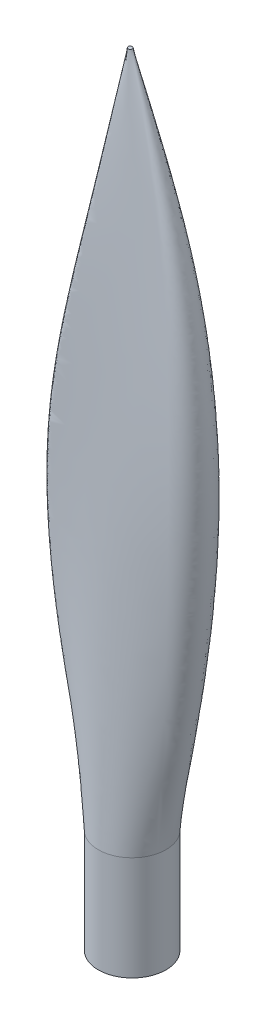
ISO-10303-21;
HEADER;
FILE_DESCRIPTION(('STEP AP214'),'2;1');
FILE_NAME('part.step','',(''),(''),'','','');
FILE_SCHEMA(('AUTOMOTIVE_DESIGN { 1 0 10303 214 1 1 1 1 }'));
ENDSEC;
DATA;
#1=APPLICATION_CONTEXT('core data for automotive mechanical design processes');
#2=APPLICATION_PROTOCOL_DEFINITION('international standard','automotive_design',2000,#1);
#3=PRODUCT_CONTEXT('',#1,'mechanical');
#4=PRODUCT('Part','Part','',(#3));
#5=PRODUCT_RELATED_PRODUCT_CATEGORY('part','',(#4));
#6=PRODUCT_DEFINITION_FORMATION('','',#4);
#7=PRODUCT_DEFINITION_CONTEXT('part definition',#1,'design');
#8=PRODUCT_DEFINITION('design','',#6,#7);
#9=PRODUCT_DEFINITION_SHAPE('','',#8);
#10=(LENGTH_UNIT() NAMED_UNIT(*) SI_UNIT(.MILLI.,.METRE.));
#11=(NAMED_UNIT(*) PLANE_ANGLE_UNIT() SI_UNIT($,.RADIAN.));
#12=(NAMED_UNIT(*) SI_UNIT($,.STERADIAN.) SOLID_ANGLE_UNIT());
#13=UNCERTAINTY_MEASURE_WITH_UNIT(LENGTH_MEASURE(1.E-05),#10,'distance_accuracy_value','');
#14=(GEOMETRIC_REPRESENTATION_CONTEXT(3) GLOBAL_UNCERTAINTY_ASSIGNED_CONTEXT((#13)) GLOBAL_UNIT_ASSIGNED_CONTEXT((#10,
#11,#12)) REPRESENTATION_CONTEXT('',''));
#15=CARTESIAN_POINT('',(0.,0.,0.));
#16=DIRECTION('',(0.,0.,1.));
#17=DIRECTION('',(1.,0.,0.));
#18=AXIS2_PLACEMENT_3D('',#15,#16,#17);
#19=CARTESIAN_POINT('',(0.,25.4,0.));
#20=DIRECTION('',(0.,-1.,0.));
#21=DIRECTION('',(0.,0.,-1.));
#22=AXIS2_PLACEMENT_3D('',#19,#20,#21);
#23=CYLINDRICAL_SURFACE('',#22,8.255);
#24=CARTESIAN_POINT('',(8.04193920322498,25.4,1.86339444338367));
#25=CARTESIAN_POINT('',(8.11469058047211,25.4,1.54941789653013));
#26=CARTESIAN_POINT('',(8.20111596359016,25.4,1.02541844738132));
#27=CARTESIAN_POINT('',(8.25713372696519,25.4,0.33787269353266));
#28=CARTESIAN_POINT('',(8.25712999938364,25.4,-0.294040831743894));
#29=CARTESIAN_POINT('',(8.21313643032507,25.4,-0.903429716545801));
#30=CARTESIAN_POINT('',(8.12374693580212,25.4,-1.50734328576073));
#31=CARTESIAN_POINT('',(7.98653543918241,25.4,-2.12325160249451));
#32=CARTESIAN_POINT('',(7.78350611399743,25.4,-2.77958408044491));
#33=CARTESIAN_POINT('',(7.5866950421925,25.4,-3.26929320480301));
#34=CARTESIAN_POINT('',(7.07615281467502,25.4,-4.33874333536382));
#35=CARTESIAN_POINT('',(6.06281840015661,25.4,-5.82189276200334));
#36=CARTESIAN_POINT('',(3.81323358915334,25.4,-7.50392490816732));
#37=CARTESIAN_POINT('',(1.03793702074819,25.4,-8.36259525259376));
#38=CARTESIAN_POINT('',(-1.93355088549847,25.4,-8.20848911095254));
#39=CARTESIAN_POINT('',(-4.69552403522382,25.4,-7.00736650120369));
#40=CARTESIAN_POINT('',(-6.85494806995589,25.4,-4.91112426952028));
#41=CARTESIAN_POINT('',(-8.12625519817877,25.4,-2.22722905695133));
#42=CARTESIAN_POINT('',(-8.30220606284296,25.4,-0.305023455910575));
#43=CARTESIAN_POINT('',(-8.22601899140763,25.4,0.694358393993185));
#44=CARTESIAN_POINT('',(-8.21596343196928,25.4,0.808584845785648));
#45=CARTESIAN_POINT('',(-8.20067106575924,25.4,0.94716211144842));
#46=CARTESIAN_POINT('',(-8.18454253711126,25.4,1.07873030970427));
#47=CARTESIAN_POINT('',(-8.16680736656137,25.4,1.20676653839371));
#48=CARTESIAN_POINT('',(-8.14669507464558,25.4,1.33474789535725));
#49=CARTESIAN_POINT('',(-8.1240024350029,25.4,1.4658351731648));
#50=CARTESIAN_POINT('',(-8.09852622127235,25.4,1.60318916438626));
#51=CARTESIAN_POINT('',(-8.0748054378678,25.4,1.71674475742405));
#52=CARTESIAN_POINT('',(-7.86392377692074,25.4,2.669782141881));
#53=CARTESIAN_POINT('',(-7.16855013672076,25.4,4.41076011906735));
#54=CARTESIAN_POINT('',(-5.25852225694168,25.3999999999999,6.58091549086592));
#55=CARTESIAN_POINT('',(-2.68411314179392,25.4,7.98747474208518));
#56=CARTESIAN_POINT('',(0.21970228756123,25.4,8.42146847642118));
#57=CARTESIAN_POINT('',(3.05849244996995,25.4,7.84240837927393));
#58=CARTESIAN_POINT('',(5.47379896842453,25.4,6.38198722144125));
#59=CARTESIAN_POINT('',(7.21609729921608,25.4,4.29178486992168));
#60=CARTESIAN_POINT('',(7.85309928772002,25.4,2.67837976492553));
#61=CARTESIAN_POINT('',(8.04193920322498,25.4,1.86339444338367));
#62=B_SPLINE_CURVE_WITH_KNOTS('',3,(#24,#25,#26,#27,#28,#29,#30,#31,#32,#33,#34,#35,#36,#37,#38,
#39,#40,#41,#42,#43,#44,#45,#46,#47,#48,#49,#50,#51,#52,#53,#54,#55,#56,#57,#58,#59,#60,#61),
.UNSPECIFIED.,.T.,.F.,(4,1,1,1,1,1,1,1,2,1,1,1,1,1,1,1,2,1,1,1,1,1,1,1,2,1,1,1,1,1,1,1,4),(0.,
0.0191823092894924,0.0383646185789849,0.0575469278684773,0.0767292371579697,0.0959115464474622,
0.115093855736955,0.134276165026447,0.153458474315939,0.205736295327291,0.258014116338642,
0.310291937349993,0.362569758361344,0.414847579372695,0.467125400384046,0.519403221395398,
0.571681042406749,0.575429611892947,0.579178181379145,0.582926750865343,0.586675320351542,
0.59042388983774,0.594172459323938,0.597921028810136,0.601669598296334,0.651460898509293,
0.701252198722251,0.751043498935209,0.800834799148167,0.850626099361125,0.900417399574084,
0.950208699787042,1.),.UNSPECIFIED.);
#63=CARTESIAN_POINT('',(8.04193920322498,25.4,1.86339444338367));
#64=VERTEX_POINT('',#63);
#65=EDGE_CURVE('E11',#64,#64,#62,.T.);
#66=ORIENTED_EDGE('',*,*,#65,.F.);
#67=EDGE_LOOP('',(#66));
#68=FACE_BOUND('',#67,.T.);
#69=CARTESIAN_POINT('',(0.,0.,0.));
#70=DIRECTION('',(0.,1.,0.));
#71=DIRECTION('',(0.,0.,1.));
#72=AXIS2_PLACEMENT_3D('',#69,#70,#71);
#73=CIRCLE('',#72,8.255);
#74=CARTESIAN_POINT('',(0.,0.,8.255));
#75=VERTEX_POINT('',#74);
#76=EDGE_CURVE('E190',#75,#75,#73,.T.);
#77=ORIENTED_EDGE('',*,*,#76,.T.);
#78=EDGE_LOOP('',(#77));
#79=FACE_BOUND('',#78,.T.);
#80=ADVANCED_FACE('F181',(#68,#79),#23,.T.);
#81=CARTESIAN_POINT('',(0.,0.,0.));
#82=DIRECTION('',(0.,1.,0.));
#83=DIRECTION('',(0.,0.,1.));
#84=AXIS2_PLACEMENT_3D('',#81,#82,#83);
#85=PLANE('',#84);
#86=ORIENTED_EDGE('',*,*,#76,.F.);
#87=EDGE_LOOP('',(#86));
#88=FACE_BOUND('',#87,.T.);
#89=ADVANCED_FACE('F205',(#88),#85,.F.);
#90=CARTESIAN_POINT('',(-0.468049409765747,190.5,0.));
#91=DIRECTION('',(0.,1.,0.));
#92=DIRECTION('',(0.,0.,1.));
#93=AXIS2_PLACEMENT_3D('',#90,#91,#92);
#94=PLANE('',#93);
#95=CARTESIAN_POINT('',(-0.468049409765747,190.5,0.));
#96=DIRECTION('',(0.,1.,0.));
#97=DIRECTION('',(0.,0.,1.));
#98=AXIS2_PLACEMENT_3D('',#95,#96,#97);
#99=CIRCLE('',#98,0.508);
#100=CARTESIAN_POINT('',(-0.468049409765747,190.5,0.508));
#101=VERTEX_POINT('',#100);
#102=EDGE_CURVE('E195',#101,#101,#99,.T.);
#103=ORIENTED_EDGE('',*,*,#102,.T.);
#104=EDGE_LOOP('',(#103));
#105=FACE_BOUND('',#104,.T.);
#106=ADVANCED_FACE('F209',(#105),#94,.T.);
#107=CARTESIAN_POINT('',(8.04193920322498,25.4,1.86339444338367));
#108=CARTESIAN_POINT('',(11.5441831228996,52.8841437795846,3.75083024995481));
#109=CARTESIAN_POINT('',(15.6087082833565,95.3193381993019,6.38417406376222));
#110=CARTESIAN_POINT('',(12.0814735561454,150.662706721941,3.34743293999606));
#111=CARTESIAN_POINT('',(3.85568550211949,177.846702543778,1.14147476846218));
#112=CARTESIAN_POINT('',(0.0268391565865594,190.5,0.114670427285149));
#113=CARTESIAN_POINT('',(8.11469058047211,25.4,1.54941789653013));
#114=CARTESIAN_POINT('',(11.8651308020688,52.8774984153459,3.55091034573232));
#115=CARTESIAN_POINT('',(16.257977972794,95.3209632198728,6.42959433380312));
#116=CARTESIAN_POINT('',(12.4353576063648,150.662452366571,3.34573554887688));
#117=CARTESIAN_POINT('',(3.97114272162727,177.8466217543,1.12775102474808));
#118=CARTESIAN_POINT('',(0.0313161644171518,190.5,0.0953487936326232));
#119=CARTESIAN_POINT('',(8.20111596359016,25.4,1.02541844738132));
#120=CARTESIAN_POINT('',(12.4820404914474,52.8621430728127,3.21985953171336));
#121=CARTESIAN_POINT('',(17.6522890450517,95.3247181303032,6.28723154333785));
#122=CARTESIAN_POINT('',(13.1887129583694,150.66186463147,3.23464229241499));
#123=CARTESIAN_POINT('',(4.21436785272417,177.846435075275,1.06975330167826));
#124=CARTESIAN_POINT('',(0.0370916774057469,190.5,0.0620653760685117));
#125=CARTESIAN_POINT('',(8.25713372696519,25.4,0.33787269353266));
#126=CARTESIAN_POINT('',(13.4021812453444,52.8389506838222,2.3661874591982));
#127=CARTESIAN_POINT('',(19.7833304047924,95.3303894686741,5.27533508309244));
#128=CARTESIAN_POINT('',(14.3321683184268,150.660976928636,2.599795193068));
#129=CARTESIAN_POINT('',(4.57939570644172,177.846153119171,0.840190590730155));
#130=CARTESIAN_POINT('',(0.0397859415223717,190.5,0.0211498365805482));
#131=CARTESIAN_POINT('',(8.25712999938364,25.4,-0.294040831743894));
#132=CARTESIAN_POINT('',(14.1299827286284,52.8204957833275,1.17414081816601));
#133=CARTESIAN_POINT('',(21.5544340915263,95.3349023278438,3.31715656233024));
#134=CARTESIAN_POINT('',(15.2340711308636,150.660270556064,1.42971503345474));
#135=CARTESIAN_POINT('',(4.86606116143318,177.845928757987,0.44194833799434));
#136=CARTESIAN_POINT('',(0.0400777029274889,190.5,-0.0178260784278905));
#137=CARTESIAN_POINT('',(8.21313643032507,25.4,-0.903429716545801));
#138=CARTESIAN_POINT('',(14.4474648245027,52.8138706939407,-0.322792730108646));
#139=CARTESIAN_POINT('',(22.407896311943,95.3365223905148,0.600645298806887));
#140=CARTESIAN_POINT('',(15.5525648015846,150.660016976725,-0.13646150407493));
#141=CARTESIAN_POINT('',(4.96550345225171,177.845848214995,-0.0813027675278552));
#142=CARTESIAN_POINT('',(0.0375584467288864,190.5,-0.0556281056638023));
#143=CARTESIAN_POINT('',(8.12374693580212,25.4,-1.50734328576073));
#144=CARTESIAN_POINT('',(14.2033168471262,52.8223411736935,-1.86213398760869));
#145=CARTESIAN_POINT('',(21.9818231580712,95.3344510663026,-2.24334260150443));
#146=CARTESIAN_POINT('',(15.1183040148477,150.660341189506,-1.67133111651742));
#147=CARTESIAN_POINT('',(4.82365560941241,177.845951192894,-0.594331516586589));
#148=CARTESIAN_POINT('',(0.0318196580343522,190.5,-0.0930219818341852));
#149=CARTESIAN_POINT('',(7.98653543918241,25.4,-2.12325160249451));
#150=CARTESIAN_POINT('',(13.4891091980645,52.8417957304304,-3.14823183065317));
#151=CARTESIAN_POINT('',(20.4781823846187,95.3296937567318,-4.49043499944706));
#152=CARTESIAN_POINT('',(14.1377266810148,150.661085824529,-2.76679141439517));
#153=CARTESIAN_POINT('',(4.5062370735515,177.846187707167,-0.968130198695069));
#154=CARTESIAN_POINT('',(0.0230807433168852,190.5,-0.130909815996951));
#155=CARTESIAN_POINT('',(7.78350611399743,25.4,-2.77958408044491));
#156=CARTESIAN_POINT('',(12.5149928288492,52.8647529964312,-4.0920555479016));
#157=CARTESIAN_POINT('',(18.4452920400145,95.324079914034,-5.81010360790168));
#158=CARTESIAN_POINT('',(12.9590952040688,150.661964527889,-3.31561927263974));
#159=CARTESIAN_POINT('',(4.12401420884587,177.846466804818,-1.16925770736253));
#160=CARTESIAN_POINT('',(0.0115611090494843,190.5,-0.170193717210012));
#161=CARTESIAN_POINT('',(7.5866950421925,25.4,-3.26929320480301));
#162=CARTESIAN_POINT('',(11.8312482553279,52.8782066842698,-4.46529671933725));
#163=CARTESIAN_POINT('',(17.0436747441378,95.3207900237124,-6.1237005109908));
#164=CARTESIAN_POINT('',(12.2042928053155,150.662479475996,-3.37466269459958));
#165=CARTESIAN_POINT('',(3.87557912684491,177.846630364915,-1.20916058660513));
#166=CARTESIAN_POINT('',(-0.00117586870774718,190.5,-0.201187274141724));
#167=CARTESIAN_POINT('',(7.07615281467502,25.4,-4.33874333536382));
#168=CARTESIAN_POINT('',(10.4726496115646,52.8996720943732,-5.24569805054088));
#169=CARTESIAN_POINT('',(14.5825246932228,95.3155409911945,-6.23860007941265));
#170=CARTESIAN_POINT('',(10.8955621900556,150.66330107766,-3.29253675359329));
#171=CARTESIAN_POINT('',(3.43845545058743,177.846891325673,-1.22798409828512));
#172=CARTESIAN_POINT('',(-0.0325938519395924,190.5,-0.266999589868543));
#173=CARTESIAN_POINT('',(6.06281840015661,25.4,-5.82189276200334));
#174=CARTESIAN_POINT('',(8.45349431739606,52.9167469864863,-6.01839667869379));
#175=CARTESIAN_POINT('',(11.0666950064587,95.3113655916327,-6.2724535986399));
#176=CARTESIAN_POINT('',(9.05699039794021,150.66395462957,-3.12132016306178));
#177=CARTESIAN_POINT('',(2.81152302787337,177.847098909724,-1.23592161323137));
#178=CARTESIAN_POINT('',(-0.0955461500544639,190.5,-0.358327721925344));
#179=CARTESIAN_POINT('',(3.81323358915334,25.4,-7.50392490816732));
#180=CARTESIAN_POINT('',(5.04301068563428,52.9201723665071,-6.86095900083288));
#181=CARTESIAN_POINT('',(6.10066022774043,95.3105279681711,-5.79390654924774));
#182=CARTESIAN_POINT('',(6.45378682021563,150.66408573808,-2.76121562872892));
#183=CARTESIAN_POINT('',(1.89105990388501,177.84714055299,-1.1922893448394));
#184=CARTESIAN_POINT('',(-0.23274637030012,190.5,-0.462003367492711));
#185=CARTESIAN_POINT('',(1.03793702074819,25.4,-8.36259525259376));
#186=CARTESIAN_POINT('',(1.43750524356472,52.9155919254587,-7.00908660276101));
#187=CARTESIAN_POINT('',(1.37855007001327,95.3116480438599,-4.94531056850153));
#188=CARTESIAN_POINT('',(3.94922742382618,150.663910418905,-2.30297935519819));
#189=CARTESIAN_POINT('',(0.978323386609847,177.847084867337,-1.08218119060542));
#190=CARTESIAN_POINT('',(-0.404539263280279,190.5,-0.513937934101064));
#191=CARTESIAN_POINT('',(-1.93355088549847,25.4,-8.20848911095254));
#192=CARTESIAN_POINT('',(-2.20839158850418,52.9145769858505,-6.43485275225023));
#193=CARTESIAN_POINT('',(-3.13764843450854,95.3118962315711,-3.75725832466107));
#194=CARTESIAN_POINT('',(1.51213197854761,150.663871571472,-1.74647849586279));
#195=CARTESIAN_POINT('',(0.0796805446163839,177.847072528443,-0.900071253047446));
#196=CARTESIAN_POINT('',(-0.587080670471897,190.5,-0.506095228233626));
#197=CARTESIAN_POINT('',(-4.69552403522382,25.4,-7.00736650120369));
#198=CARTESIAN_POINT('',(-5.66696235295416,52.9217234315511,-5.10412115754754));
#199=CARTESIAN_POINT('',(-7.50382055298108,95.3101486793145,-2.26186093728583));
#200=CARTESIAN_POINT('',(-0.885882294913625,150.66414510604,-1.09134252943772));
#201=CARTESIAN_POINT('',(-0.797613014777569,177.847159409704,-0.640358143399943));
#202=CARTESIAN_POINT('',(-0.756526433351932,190.5,-0.430439056373617));
#203=CARTESIAN_POINT('',(-6.85494806995589,25.4,-4.91112426952028));
#204=CARTESIAN_POINT('',(-8.73017936050656,52.9337668494141,-3.12786874683926));
#205=CARTESIAN_POINT('',(-11.7620459798454,95.3072036486031,-0.438685774633264));
#206=CARTESIAN_POINT('',(-3.26877819805873,150.664606075205,-0.32745524656364));
#207=CARTESIAN_POINT('',(-1.64602346519309,177.847305824771,-0.310345807824605));
#208=CARTESIAN_POINT('',(-0.89068203312349,190.5,-0.30238190071202));
#209=CARTESIAN_POINT('',(-8.12625519817877,25.4,-2.22722905695133));
#210=CARTESIAN_POINT('',(-11.2166954888907,52.9387497669766,-0.595063540721891));
#211=CARTESIAN_POINT('',(-15.9478800914349,95.3059851535362,1.72731785865566));
#212=CARTESIAN_POINT('',(-5.66153974736434,150.664796799414,0.556141966480628));
#213=CARTESIAN_POINT('',(-2.4583413430728,177.847366403438,0.0829293757197126));
#214=CARTESIAN_POINT('',(-0.967352950989676,190.5,-0.137336243439821));
#215=CARTESIAN_POINT('',(-8.30220606284296,25.4,-0.305023455910575));
#216=CARTESIAN_POINT('',(-12.5039020775172,52.9288886951155,1.12818228665446));
#217=CARTESIAN_POINT('',(-18.6741999196082,95.3083965254415,3.49227636962606));
#218=CARTESIAN_POINT('',(-7.28466690961243,150.664419360874,1.23552808435542));
#219=CARTESIAN_POINT('',(-2.98180272237518,177.847246519738,0.379625250440891));
#220=CARTESIAN_POINT('',(-0.978954398248391,190.5,-0.0187706742098816));
#221=CARTESIAN_POINT('',(-8.22601899140763,25.4,0.694358393993185));
#222=CARTESIAN_POINT('',(-13.038055972031,52.9147449107307,2.22571676714088));
#223=CARTESIAN_POINT('',(-20.1283081934722,95.311855168151,4.48644186778471));
#224=CARTESIAN_POINT('',(-8.16533989160325,150.6638779989,1.63635335652534));
#225=CARTESIAN_POINT('',(-3.25832670014532,177.847074569951,0.548903533271238));
#226=CARTESIAN_POINT('',(-0.974265963083141,190.5,0.0427297473226576));
#227=CARTESIAN_POINT('',(-8.21596343196928,25.4,0.808584845785648));
#228=CARTESIAN_POINT('',(-13.1098155333761,52.9127672583671,2.35504221046697));
#229=CARTESIAN_POINT('',(-20.3037094238521,95.312338772309,4.6616065001011));
#230=CARTESIAN_POINT('',(-8.28999076914095,150.663802303049,1.70654197756516));
#231=CARTESIAN_POINT('',(-3.29749660721519,177.8470505271,0.575993790157797));
#232=CARTESIAN_POINT('',(-0.973647159425396,190.5,0.0497590674329629));
#233=CARTESIAN_POINT('',(-8.20067106575924,25.4,0.94716211144842));
#234=CARTESIAN_POINT('',(-13.1745044475393,52.909018658758,2.58495866502019));
#235=CARTESIAN_POINT('',(-20.4670892766014,95.3132554340975,5.00676655860603));
#236=CARTESIAN_POINT('',(-8.48186710698137,150.663658823113,1.89731283916783));
#237=CARTESIAN_POINT('',(-3.357799056817,177.847004954368,0.642406459853334));
#238=CARTESIAN_POINT('',(-0.972706090735548,190.5,0.0582868991660566));
#239=CARTESIAN_POINT('',(-8.18454253711126,25.4,1.07873030970427));
#240=CARTESIAN_POINT('',(-13.1860943353689,52.9055110665919,2.82463917728398));
#241=CARTESIAN_POINT('',(-20.4939824619147,95.3141131612632,5.37925863724512));
#242=CARTESIAN_POINT('',(-8.63579305391957,150.663524567883,2.2104535247223));
#243=CARTESIAN_POINT('',(-3.40601242282892,177.846962311627,0.747392447618418));
#244=CARTESIAN_POINT('',(-0.971713565895671,190.5,0.0663834036741092));
#245=CARTESIAN_POINT('',(-8.16680736656137,25.4,1.20676653839371));
#246=CARTESIAN_POINT('',(-13.1418150172977,52.9037392924822,3.05555484466214));
#247=CARTESIAN_POINT('',(-20.4031198811469,95.3145464210916,5.70895740744371));
#248=CARTESIAN_POINT('',(-8.6444165099118,150.663456752149,2.64123784734673));
#249=CARTESIAN_POINT('',(-3.40800670173448,177.846940771694,0.889596612537117));
#250=CARTESIAN_POINT('',(-0.970622170784908,190.5,0.074262556208844));
#251=CARTESIAN_POINT('',(-8.14669507464558,25.4,1.33474789535725));
#252=CARTESIAN_POINT('',(-13.0531475165617,52.9050130644456,3.26664411624343));
#253=CARTESIAN_POINT('',(-20.2356298932239,95.3142349399499,5.99482097079941));
#254=CARTESIAN_POINT('',(-8.45118768590756,150.663505506547,3.02455947139849));
#255=CARTESIAN_POINT('',(-3.3457879449438,177.846956257281,1.01672316081886));
#256=CARTESIAN_POINT('',(-0.969384491282398,190.5,0.082138332021985));
#257=CARTESIAN_POINT('',(-8.1240024350029,25.4,1.4658351731648));
#258=CARTESIAN_POINT('',(-12.9215565221592,52.9081682200574,3.45065115710083));
#259=CARTESIAN_POINT('',(-19.9716492031901,95.3134633956683,6.23829831145033));
#260=CARTESIAN_POINT('',(-8.18167392527566,150.663626272053,3.24031702532218));
#261=CARTESIAN_POINT('',(-3.25923087401074,177.846994615356,1.09075769221029));
#262=CARTESIAN_POINT('',(-0.967988021150541,190.5,0.0902052414255261));
#263=CARTESIAN_POINT('',(-8.09852622127235,25.4,1.60318916438626));
#264=CARTESIAN_POINT('',(-12.763152712143,52.9118727784796,3.59658861072036));
#265=CARTESIAN_POINT('',(-19.6411997802011,95.3125575034668,6.3799680997832));
#266=CARTESIAN_POINT('',(-7.92891125880278,150.663768066286,3.33436028209035));
#267=CARTESIAN_POINT('',(-3.17787747096619,177.847039652668,1.12639594367187));
#268=CARTESIAN_POINT('',(-0.966420254151739,190.5,0.098657794731462));
#269=CARTESIAN_POINT('',(-8.0748054378678,25.4,1.71674475742405));
#270=CARTESIAN_POINT('',(-12.6516994503611,52.9144183605694,3.66419306746508));
#271=CARTESIAN_POINT('',(-19.4027269155437,95.3119350209192,6.4037404846899));
#272=CARTESIAN_POINT('',(-7.78678349451257,150.663865499993,3.34689810696751));
#273=CARTESIAN_POINT('',(-3.13173812998127,177.847070599993,1.13514672852224));
#274=CARTESIAN_POINT('',(-0.964960513634535,190.5,0.105645831226095));
#275=CARTESIAN_POINT('',(-7.86392377692074,25.4,2.669782141881));
#276=CARTESIAN_POINT('',(-11.8234694361911,52.9319622421454,4.2779601570574));
#277=CARTESIAN_POINT('',(-17.7757554869773,95.3076449372711,6.26417704368356));
#278=CARTESIAN_POINT('',(-6.85929169392923,150.664537002761,3.35231575932165));
#279=CARTESIAN_POINT('',(-2.82828866311728,177.847283885675,1.17688777993545));
#280=CARTESIAN_POINT('',(-0.951983180653178,190.5,0.164294285654216));
#281=CARTESIAN_POINT('',(-7.16855013672076,25.4,4.41076011906735));
#282=CARTESIAN_POINT('',(-10.2066930228112,52.9489035917777,5.11327699958084));
#283=CARTESIAN_POINT('',(-14.8104938522524,95.3035021934481,6.07915219550321));
#284=CARTESIAN_POINT('',(-5.17900737483871,150.665185443251,3.35124502986984));
#285=CARTESIAN_POINT('',(-2.26486701282094,177.847489846214,1.24971032260837));
#286=CARTESIAN_POINT('',(-0.908426073399836,190.5,0.27151182891261));
#287=CARTESIAN_POINT('',(-5.25852225694168,25.3999999999999,6.58091549086592));
#288=CARTESIAN_POINT('',(-7.28265629690635,52.9447277024393,6.35531416663394));
#289=CARTESIAN_POINT('',(-10.5622608354395,95.3045233423022,5.79944171752309));
#290=CARTESIAN_POINT('',(-2.73931732990261,150.665025608539,3.35754666539142));
#291=CARTESIAN_POINT('',(-1.41074114141833,177.847439078806,1.34301981940446));
#292=CARTESIAN_POINT('',(-0.79233059514241,190.5,0.405320756217425));
#293=CARTESIAN_POINT('',(-2.68411314179392,25.4,7.98747474208518));
#294=CARTESIAN_POINT('',(-4.02438585017287,52.9309657290082,7.11585171759909));
#295=CARTESIAN_POINT('',(-6.4244903643884,95.3078886190754,5.6287835604614));
#296=CARTESIAN_POINT('',(-0.343265610273595,150.664498860613,3.36034535586273));
#297=CARTESIAN_POINT('',(-0.540955824072959,177.847271770797,1.40216641659955));
#298=CARTESIAN_POINT('',(-0.632974418240708,190.5,0.490695536696688));
#299=CARTESIAN_POINT('',(0.21970228756123,25.4,8.42146847642118));
#300=CARTESIAN_POINT('',(-0.579104675591121,52.9213297197925,7.35925202898538));
#301=CARTESIAN_POINT('',(-2.32104782105707,95.3102449554075,5.57436497266915));
#302=CARTESIAN_POINT('',(2.03922379392054,150.664130036483,3.36090033590112));
#303=CARTESIAN_POINT('',(0.337686732262329,177.847154623244,1.42174168909829));
#304=CARTESIAN_POINT('',(-0.454325402931252,190.5,0.519124158783276));
#305=CARTESIAN_POINT('',(3.05849244996995,25.4,7.84240837927393));
#306=CARTESIAN_POINT('',(2.84947068942193,52.9210654487489,7.03687587713052));
#307=CARTESIAN_POINT('',(1.83801603110905,95.3103095787851,5.64655254180441));
#308=CARTESIAN_POINT('',(4.4360645676818,150.664119921347,3.35997319594733));
#309=CARTESIAN_POINT('',(1.21769751343649,177.84715141043,1.39617914785883));
#310=CARTESIAN_POINT('',(-0.280351409450566,190.5,0.482094610910064));
#311=CARTESIAN_POINT('',(5.47379896842453,25.4,6.38198722144125));
#312=CARTESIAN_POINT('',(6.08050865289218,52.9253843869315,6.24490997982323));
#313=CARTESIAN_POINT('',(6.14576376832125,95.3092534495591,5.82418738821488));
#314=CARTESIAN_POINT('',(6.87696402964508,150.66428523134,3.3571886350154));
#315=CARTESIAN_POINT('',(2.09519705177865,177.847203916922,1.33434224777878));
#316=CARTESIAN_POINT('',(-0.13056550107892,190.5,0.392770699074121));
#317=CARTESIAN_POINT('',(7.21609729921608,25.4,4.29178486992168));
#318=CARTESIAN_POINT('',(9.01531655451915,52.9219811253014,5.0541288094161));
#319=CARTESIAN_POINT('',(10.6751721672993,95.3100856643119,6.09232480202205));
#320=CARTESIAN_POINT('',(9.39477341615375,150.664154969426,3.35119868292573));
#321=CARTESIAN_POINT('',(2.96730446467903,177.847162542556,1.24478550026031));
#322=CARTESIAN_POINT('',(-0.0244807410965826,190.5,0.264316229272514));
#323=CARTESIAN_POINT('',(7.85309928772002,25.4,2.67837976492553));
#324=CARTESIAN_POINT('',(10.7111029131607,52.9013930753205,4.26976005238173));
#325=CARTESIAN_POINT('',(13.9234063972243,95.3151201520439,6.26627718976077));
#326=CARTESIAN_POINT('',(11.1629007858321,150.663366949256,3.35183883865602));
#327=CARTESIAN_POINT('',(3.5559945216694,177.846912248101,1.17709733261764));
#328=CARTESIAN_POINT('',(0.0152182387093306,190.5,0.164823370149264));
#329=CARTESIAN_POINT('',(8.04193920322498,25.4,1.86339444338367));
#330=CARTESIAN_POINT('',(11.5441831228996,52.8841437795846,3.75083024995481));
#331=CARTESIAN_POINT('',(15.6087082833565,95.3193381993019,6.38417406376222));
#332=CARTESIAN_POINT('',(12.0814735561454,150.662706721941,3.34743293999606));
#333=CARTESIAN_POINT('',(3.85568550211949,177.846702543778,1.14147476846218));
#334=CARTESIAN_POINT('',(0.0268391565865594,190.5,0.114670427285149));
#335=B_SPLINE_SURFACE_WITH_KNOTS('',3,3,((#107,#108,#109,#110,#111,#112),(#113,#114,#115,#116,
#117,#118),(#119,#120,#121,#122,#123,#124),(#125,#126,#127,#128,#129,#130),(#131,#132,#133,#134,
#135,#136),(#137,#138,#139,#140,#141,#142),(#143,#144,#145,#146,#147,#148),(#149,#150,#151,#152,
#153,#154),(#155,#156,#157,#158,#159,#160),(#161,#162,#163,#164,#165,#166),(#167,#168,#169,#170,
#171,#172),(#173,#174,#175,#176,#177,#178),(#179,#180,#181,#182,#183,#184),(#185,#186,#187,#188,
#189,#190),(#191,#192,#193,#194,#195,#196),(#197,#198,#199,#200,#201,#202),(#203,#204,#205,#206,
#207,#208),(#209,#210,#211,#212,#213,#214),(#215,#216,#217,#218,#219,#220),(#221,#222,#223,#224,
#225,#226),(#227,#228,#229,#230,#231,#232),(#233,#234,#235,#236,#237,#238),(#239,#240,#241,#242,
#243,#244),(#245,#246,#247,#248,#249,#250),(#251,#252,#253,#254,#255,#256),(#257,#258,#259,#260,
#261,#262),(#263,#264,#265,#266,#267,#268),(#269,#270,#271,#272,#273,#274),(#275,#276,#277,#278,
#279,#280),(#281,#282,#283,#284,#285,#286),(#287,#288,#289,#290,#291,#292),(#293,#294,#295,#296,
#297,#298),(#299,#300,#301,#302,#303,#304),(#305,#306,#307,#308,#309,#310),(#311,#312,#313,#314,
#315,#316),(#317,#318,#319,#320,#321,#322),(#323,#324,#325,#326,#327,#328),(#329,#330,#331,#332,
#333,#334)),.UNSPECIFIED.,.T.,.F.,.F.,(4,1,1,1,1,1,1,1,2,1,1,1,1,1,1,1,2,1,1,1,1,1,1,1,2,1,1,1,
1,1,1,1,4),(4,1,1,4),(0.,0.0191823092894924,0.0383646185789849,0.0575469278684773,
0.0767292371579697,0.0959115464474622,0.115093855736955,0.134276165026447,0.153458474315939,
0.205736295327291,0.258014116338642,0.310291937349993,0.362569758361344,0.414847579372695,
0.467125400384046,0.519403221395398,0.571681042406749,0.575429611892947,0.579178181379145,
0.582926750865343,0.586675320351542,0.59042388983774,0.594172459323938,0.597921028810136,
0.601669598296334,0.651460898509293,0.701252198722251,0.751043498935209,0.800834799148167,
0.850626099361125,0.900417399574084,0.950208699787042,1.),(0.,0.497127407831378,
0.765928580441462,1.),.UNSPECIFIED.);
#336=ORIENTED_EDGE('',*,*,#65,.T.);
#337=EDGE_LOOP('',(#336));
#338=FACE_BOUND('',#337,.T.);
#339=ORIENTED_EDGE('',*,*,#102,.F.);
#340=EDGE_LOOP('',(#339));
#341=FACE_BOUND('',#340,.T.);
#342=ADVANCED_FACE('F214',(#338,#341),#335,.T.);
#343=CLOSED_SHELL('',(#80,#89,#106,#342));
#344=MANIFOLD_SOLID_BREP('B2',#343);
#345=ADVANCED_BREP_SHAPE_REPRESENTATION('',(#18,#344),#14);
#346=SHAPE_DEFINITION_REPRESENTATION(#9,#345);
ENDSEC;
END-ISO-10303-21;
